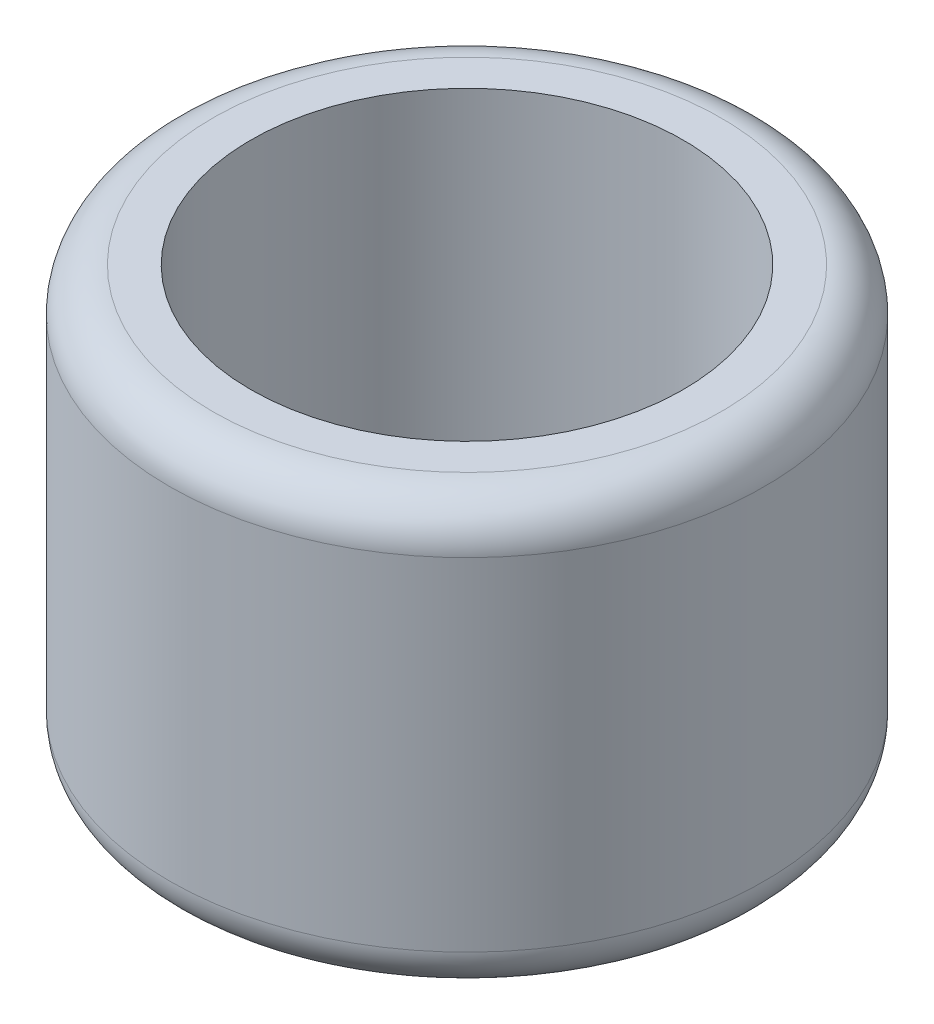
ISO-10303-21;
HEADER;
FILE_DESCRIPTION(('STEP AP214'),'2;1');
FILE_NAME('part.step','',(''),(''),'','','');
FILE_SCHEMA(('AUTOMOTIVE_DESIGN { 1 0 10303 214 1 1 1 1 }'));
ENDSEC;
DATA;
#1=APPLICATION_CONTEXT('core data for automotive mechanical design processes');
#2=APPLICATION_PROTOCOL_DEFINITION('international standard','automotive_design',2000,#1);
#3=PRODUCT_CONTEXT('',#1,'mechanical');
#4=PRODUCT('Part','Part','',(#3));
#5=PRODUCT_RELATED_PRODUCT_CATEGORY('part','',(#4));
#6=PRODUCT_DEFINITION_FORMATION('','',#4);
#7=PRODUCT_DEFINITION_CONTEXT('part definition',#1,'design');
#8=PRODUCT_DEFINITION('design','',#6,#7);
#9=PRODUCT_DEFINITION_SHAPE('','',#8);
#10=(LENGTH_UNIT() NAMED_UNIT(*) SI_UNIT(.MILLI.,.METRE.));
#11=(NAMED_UNIT(*) PLANE_ANGLE_UNIT() SI_UNIT($,.RADIAN.));
#12=(NAMED_UNIT(*) SI_UNIT($,.STERADIAN.) SOLID_ANGLE_UNIT());
#13=UNCERTAINTY_MEASURE_WITH_UNIT(LENGTH_MEASURE(1.E-05),#10,'distance_accuracy_value','');
#14=(GEOMETRIC_REPRESENTATION_CONTEXT(3) GLOBAL_UNCERTAINTY_ASSIGNED_CONTEXT((#13)) GLOBAL_UNIT_ASSIGNED_CONTEXT((#10,
#11,#12)) REPRESENTATION_CONTEXT('',''));
#15=CARTESIAN_POINT('',(0.,0.,0.));
#16=DIRECTION('',(0.,0.,1.));
#17=DIRECTION('',(1.,0.,0.));
#18=AXIS2_PLACEMENT_3D('',#15,#16,#17);
#19=CARTESIAN_POINT('',(0.,6.2865,0.));
#20=DIRECTION('',(0.,1.,0.));
#21=DIRECTION('',(0.,0.,1.));
#22=AXIS2_PLACEMENT_3D('',#19,#20,#21);
#23=PLANE('',#22);
#24=CARTESIAN_POINT('',(0.,6.2865,0.));
#25=DIRECTION('',(0.,1.,0.));
#26=DIRECTION('',(0.,0.,1.));
#27=AXIS2_PLACEMENT_3D('',#24,#25,#26);
#28=CIRCLE('',#27,7.4676);
#29=CARTESIAN_POINT('',(0.,6.2865,7.4676));
#30=VERTEX_POINT('',#29);
#31=EDGE_CURVE('E10',#30,#30,#28,.T.);
#32=ORIENTED_EDGE('',*,*,#31,.T.);
#33=EDGE_LOOP('',(#32));
#34=FACE_BOUND('',#33,.T.);
#35=CARTESIAN_POINT('',(0.,6.2865,0.));
#36=DIRECTION('',(0.,1.,0.));
#37=DIRECTION('',(0.,0.,1.));
#38=AXIS2_PLACEMENT_3D('',#35,#36,#37);
#39=CIRCLE('',#38,6.35);
#40=CARTESIAN_POINT('',(0.,6.2865,6.35));
#41=VERTEX_POINT('',#40);
#42=EDGE_CURVE('E62',#41,#41,#39,.T.);
#43=ORIENTED_EDGE('',*,*,#42,.F.);
#44=EDGE_LOOP('',(#43));
#45=FACE_BOUND('',#44,.T.);
#46=ADVANCED_FACE('F38',(#34,#45),#23,.T.);
#47=CARTESIAN_POINT('',(0.,-6.2865,0.));
#48=DIRECTION('',(0.,1.,0.));
#49=DIRECTION('',(0.,0.,1.));
#50=AXIS2_PLACEMENT_3D('',#47,#48,#49);
#51=PLANE('',#50);
#52=CARTESIAN_POINT('',(0.,-6.2865,0.));
#53=DIRECTION('',(0.,1.,0.));
#54=DIRECTION('',(0.,0.,1.));
#55=AXIS2_PLACEMENT_3D('',#52,#53,#54);
#56=CIRCLE('',#55,7.4676);
#57=CARTESIAN_POINT('',(0.,-6.2865,7.4676));
#58=VERTEX_POINT('',#57);
#59=EDGE_CURVE('E46',#58,#58,#56,.F.);
#60=ORIENTED_EDGE('',*,*,#59,.T.);
#61=EDGE_LOOP('',(#60));
#62=FACE_BOUND('',#61,.T.);
#63=CARTESIAN_POINT('',(0.,-6.2865,0.));
#64=DIRECTION('',(0.,1.,0.));
#65=DIRECTION('',(0.,0.,1.));
#66=AXIS2_PLACEMENT_3D('',#63,#64,#65);
#67=CIRCLE('',#66,6.35);
#68=CARTESIAN_POINT('',(0.,-6.2865,6.35));
#69=VERTEX_POINT('',#68);
#70=EDGE_CURVE('E63',#69,#69,#67,.T.);
#71=ORIENTED_EDGE('',*,*,#70,.T.);
#72=EDGE_LOOP('',(#71));
#73=FACE_BOUND('',#72,.T.);
#74=ADVANCED_FACE('F75',(#62,#73),#51,.F.);
#75=CARTESIAN_POINT('',(0.,6.2865,0.));
#76=DIRECTION('',(0.,-1.,0.));
#77=DIRECTION('',(0.,0.,-1.));
#78=AXIS2_PLACEMENT_3D('',#75,#76,#77);
#79=CYLINDRICAL_SURFACE('',#78,8.7376);
#80=CARTESIAN_POINT('',(0.,-5.0165,0.));
#81=DIRECTION('',(0.,1.,0.));
#82=DIRECTION('',(0.,0.,1.));
#83=AXIS2_PLACEMENT_3D('',#80,#81,#82);
#84=CIRCLE('',#83,8.7376);
#85=CARTESIAN_POINT('',(0.,-5.0165,8.7376));
#86=VERTEX_POINT('',#85);
#87=EDGE_CURVE('E51',#86,#86,#84,.T.);
#88=ORIENTED_EDGE('',*,*,#87,.T.);
#89=EDGE_LOOP('',(#88));
#90=FACE_BOUND('',#89,.T.);
#91=CARTESIAN_POINT('',(0.,5.0165,0.));
#92=DIRECTION('',(0.,1.,0.));
#93=DIRECTION('',(0.,0.,1.));
#94=AXIS2_PLACEMENT_3D('',#91,#92,#93);
#95=CIRCLE('',#94,8.7376);
#96=CARTESIAN_POINT('',(0.,5.0165,8.7376));
#97=VERTEX_POINT('',#96);
#98=EDGE_CURVE('E56',#97,#97,#95,.F.);
#99=ORIENTED_EDGE('',*,*,#98,.T.);
#100=EDGE_LOOP('',(#99));
#101=FACE_BOUND('',#100,.T.);
#102=ADVANCED_FACE('F80',(#90,#101),#79,.T.);
#103=CARTESIAN_POINT('',(0.,6.2865,0.));
#104=DIRECTION('',(0.,-1.,0.));
#105=DIRECTION('',(0.,0.,-1.));
#106=AXIS2_PLACEMENT_3D('',#103,#104,#105);
#107=CYLINDRICAL_SURFACE('',#106,6.35);
#108=ORIENTED_EDGE('',*,*,#42,.T.);
#109=EDGE_LOOP('',(#108));
#110=FACE_BOUND('',#109,.T.);
#111=ORIENTED_EDGE('',*,*,#70,.F.);
#112=EDGE_LOOP('',(#111));
#113=FACE_BOUND('',#112,.T.);
#114=ADVANCED_FACE('F71',(#110,#113),#107,.F.);
#115=CARTESIAN_POINT('',(0.,-5.0165,0.));
#116=DIRECTION('',(0.,1.,0.));
#117=DIRECTION('',(0.,0.,1.));
#118=AXIS2_PLACEMENT_3D('',#115,#116,#117);
#119=TOROIDAL_SURFACE('',#118,7.4676,1.27);
#120=ORIENTED_EDGE('',*,*,#59,.F.);
#121=EDGE_LOOP('',(#120));
#122=FACE_BOUND('',#121,.T.);
#123=ORIENTED_EDGE('',*,*,#87,.F.);
#124=EDGE_LOOP('',(#123));
#125=FACE_BOUND('',#124,.T.);
#126=ADVANCED_FACE('F86',(#122,#125),#119,.T.);
#127=CARTESIAN_POINT('',(0.,5.0165,0.));
#128=DIRECTION('',(0.,1.,0.));
#129=DIRECTION('',(0.,0.,1.));
#130=AXIS2_PLACEMENT_3D('',#127,#128,#129);
#131=TOROIDAL_SURFACE('',#130,7.4676,1.27);
#132=ORIENTED_EDGE('',*,*,#98,.F.);
#133=EDGE_LOOP('',(#132));
#134=FACE_BOUND('',#133,.T.);
#135=ORIENTED_EDGE('',*,*,#31,.F.);
#136=EDGE_LOOP('',(#135));
#137=FACE_BOUND('',#136,.T.);
#138=ADVANCED_FACE('F40',(#134,#137),#131,.T.);
#139=CLOSED_SHELL('',(#46,#74,#102,#114,#126,#138));
#140=MANIFOLD_SOLID_BREP('B2',#139);
#141=ADVANCED_BREP_SHAPE_REPRESENTATION('',(#18,#140),#14);
#142=SHAPE_DEFINITION_REPRESENTATION(#9,#141);
ENDSEC;
END-ISO-10303-21;
